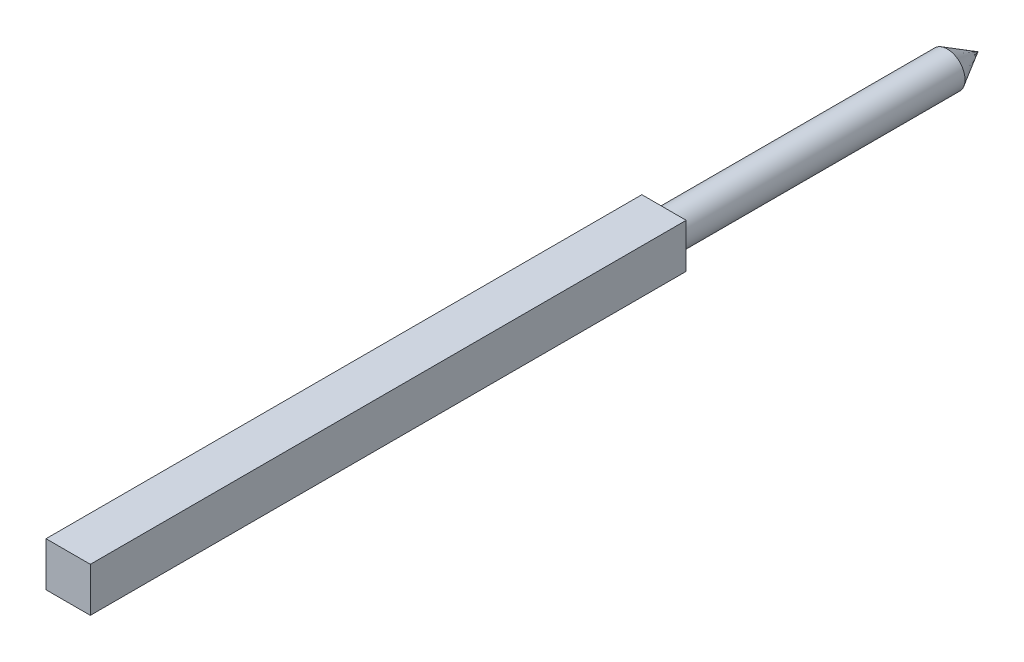
ISO-10303-21;
HEADER;
FILE_DESCRIPTION(('STEP AP214'),'2;1');
FILE_NAME('part.step','',(''),(''),'','','');
FILE_SCHEMA(('AUTOMOTIVE_DESIGN { 1 0 10303 214 1 1 1 1 }'));
ENDSEC;
DATA;
#1=APPLICATION_CONTEXT('core data for automotive mechanical design processes');
#2=APPLICATION_PROTOCOL_DEFINITION('international standard','automotive_design',2000,#1);
#3=PRODUCT_CONTEXT('',#1,'mechanical');
#4=PRODUCT('Part','Part','',(#3));
#5=PRODUCT_RELATED_PRODUCT_CATEGORY('part','',(#4));
#6=PRODUCT_DEFINITION_FORMATION('','',#4);
#7=PRODUCT_DEFINITION_CONTEXT('part definition',#1,'design');
#8=PRODUCT_DEFINITION('design','',#6,#7);
#9=PRODUCT_DEFINITION_SHAPE('','',#8);
#10=(LENGTH_UNIT() NAMED_UNIT(*) SI_UNIT(.MILLI.,.METRE.));
#11=(NAMED_UNIT(*) PLANE_ANGLE_UNIT() SI_UNIT($,.RADIAN.));
#12=(NAMED_UNIT(*) SI_UNIT($,.STERADIAN.) SOLID_ANGLE_UNIT());
#13=UNCERTAINTY_MEASURE_WITH_UNIT(LENGTH_MEASURE(1.E-05),#10,'distance_accuracy_value','');
#14=(GEOMETRIC_REPRESENTATION_CONTEXT(3) GLOBAL_UNCERTAINTY_ASSIGNED_CONTEXT((#13)) GLOBAL_UNIT_ASSIGNED_CONTEXT((#10,
#11,#12)) REPRESENTATION_CONTEXT('',''));
#15=CARTESIAN_POINT('',(0.,0.,0.));
#16=DIRECTION('',(0.,0.,1.));
#17=DIRECTION('',(1.,0.,0.));
#18=AXIS2_PLACEMENT_3D('',#15,#16,#17);
#19=CARTESIAN_POINT('',(-3.13055,-3.1242,84.1375));
#20=DIRECTION('',(0.,1.,0.));
#21=DIRECTION('',(0.,0.,1.));
#22=AXIS2_PLACEMENT_3D('',#19,#20,#21);
#23=PLANE('',#22);
#24=DIRECTION('',(1.,0.,0.));
#25=VECTOR('',#24,1.);
#26=CARTESIAN_POINT('',(-3.13055,-3.1242,0.));
#27=LINE('',#26,#25);
#28=CARTESIAN_POINT('',(-3.13055,-3.1242,0.));
#29=VERTEX_POINT('',#28);
#30=CARTESIAN_POINT('',(3.13055,-3.1242,0.));
#31=VERTEX_POINT('',#30);
#32=EDGE_CURVE('E108',#29,#31,#27,.T.);
#33=ORIENTED_EDGE('',*,*,#32,.T.);
#34=DIRECTION('',(0.,0.,-1.));
#35=VECTOR('',#34,1.);
#36=CARTESIAN_POINT('',(3.13055,-3.1242,84.1375));
#37=LINE('',#36,#35);
#38=CARTESIAN_POINT('',(3.13055,-3.1242,84.1375));
#39=VERTEX_POINT('',#38);
#40=EDGE_CURVE('E13',#39,#31,#37,.T.);
#41=ORIENTED_EDGE('',*,*,#40,.F.);
#42=DIRECTION('',(1.,0.,0.));
#43=VECTOR('',#42,1.);
#44=CARTESIAN_POINT('',(-3.13055,-3.1242,84.1375));
#45=LINE('',#44,#43);
#46=CARTESIAN_POINT('',(-3.13055,-3.1242,84.1375));
#47=VERTEX_POINT('',#46);
#48=EDGE_CURVE('E111',#47,#39,#45,.T.);
#49=ORIENTED_EDGE('',*,*,#48,.F.);
#50=DIRECTION('',(0.,0.,-1.));
#51=VECTOR('',#50,1.);
#52=CARTESIAN_POINT('',(-3.13055,-3.1242,84.1375));
#53=LINE('',#52,#51);
#54=EDGE_CURVE('E65',#47,#29,#53,.T.);
#55=ORIENTED_EDGE('',*,*,#54,.T.);
#56=EDGE_LOOP('',(#33,#41,#49,#55));
#57=FACE_BOUND('',#56,.T.);
#58=ADVANCED_FACE('F49',(#57),#23,.F.);
#59=CARTESIAN_POINT('',(3.13055,-3.1242,84.1375));
#60=DIRECTION('',(-1.,0.,0.));
#61=DIRECTION('',(0.,0.,1.));
#62=AXIS2_PLACEMENT_3D('',#59,#60,#61);
#63=PLANE('',#62);
#64=DIRECTION('',(0.,1.,0.));
#65=VECTOR('',#64,1.);
#66=CARTESIAN_POINT('',(3.13055,-3.1242,0.));
#67=LINE('',#66,#65);
#68=CARTESIAN_POINT('',(3.13055,3.1242,0.));
#69=VERTEX_POINT('',#68);
#70=EDGE_CURVE('E121',#31,#69,#67,.T.);
#71=ORIENTED_EDGE('',*,*,#70,.T.);
#72=DIRECTION('',(0.,0.,-1.));
#73=VECTOR('',#72,1.);
#74=CARTESIAN_POINT('',(3.13055,3.1242,84.1375));
#75=LINE('',#74,#73);
#76=CARTESIAN_POINT('',(3.13055,3.1242,84.1375));
#77=VERTEX_POINT('',#76);
#78=EDGE_CURVE('E57',#77,#69,#75,.T.);
#79=ORIENTED_EDGE('',*,*,#78,.F.);
#80=DIRECTION('',(0.,1.,0.));
#81=VECTOR('',#80,1.);
#82=CARTESIAN_POINT('',(3.13055,-3.1242,84.1375));
#83=LINE('',#82,#81);
#84=EDGE_CURVE('E91',#39,#77,#83,.T.);
#85=ORIENTED_EDGE('',*,*,#84,.F.);
#86=ORIENTED_EDGE('',*,*,#40,.T.);
#87=EDGE_LOOP('',(#71,#79,#85,#86));
#88=FACE_BOUND('',#87,.T.);
#89=ADVANCED_FACE('F133',(#88),#63,.F.);
#90=CARTESIAN_POINT('',(-3.13055,3.1242,84.1375));
#91=DIRECTION('',(0.,1.,0.));
#92=DIRECTION('',(0.,0.,1.));
#93=AXIS2_PLACEMENT_3D('',#90,#91,#92);
#94=PLANE('',#93);
#95=DIRECTION('',(1.,0.,0.));
#96=VECTOR('',#95,1.);
#97=CARTESIAN_POINT('',(-3.13055,3.1242,0.));
#98=LINE('',#97,#96);
#99=CARTESIAN_POINT('',(-3.13055,3.1242,0.));
#100=VERTEX_POINT('',#99);
#101=EDGE_CURVE('E124',#100,#69,#98,.T.);
#102=ORIENTED_EDGE('',*,*,#101,.F.);
#103=DIRECTION('',(0.,0.,-1.));
#104=VECTOR('',#103,1.);
#105=CARTESIAN_POINT('',(-3.13055,3.1242,84.1375));
#106=LINE('',#105,#104);
#107=CARTESIAN_POINT('',(-3.13055,3.1242,84.1375));
#108=VERTEX_POINT('',#107);
#109=EDGE_CURVE('E80',#108,#100,#106,.T.);
#110=ORIENTED_EDGE('',*,*,#109,.F.);
#111=DIRECTION('',(1.,0.,0.));
#112=VECTOR('',#111,1.);
#113=CARTESIAN_POINT('',(-3.13055,3.1242,84.1375));
#114=LINE('',#113,#112);
#115=EDGE_CURVE('E115',#108,#77,#114,.T.);
#116=ORIENTED_EDGE('',*,*,#115,.T.);
#117=ORIENTED_EDGE('',*,*,#78,.T.);
#118=EDGE_LOOP('',(#102,#110,#116,#117));
#119=FACE_BOUND('',#118,.T.);
#120=ADVANCED_FACE('F131',(#119),#94,.T.);
#121=CARTESIAN_POINT('',(-3.13055,-3.1242,84.1375));
#122=DIRECTION('',(-1.,0.,0.));
#123=DIRECTION('',(0.,0.,1.));
#124=AXIS2_PLACEMENT_3D('',#121,#122,#123);
#125=PLANE('',#124);
#126=DIRECTION('',(0.,1.,0.));
#127=VECTOR('',#126,1.);
#128=CARTESIAN_POINT('',(-3.13055,-3.1242,0.));
#129=LINE('',#128,#127);
#130=EDGE_CURVE('E113',#29,#100,#129,.T.);
#131=ORIENTED_EDGE('',*,*,#130,.F.);
#132=ORIENTED_EDGE('',*,*,#54,.F.);
#133=DIRECTION('',(0.,1.,0.));
#134=VECTOR('',#133,1.);
#135=CARTESIAN_POINT('',(-3.13055,-3.1242,84.1375));
#136=LINE('',#135,#134);
#137=EDGE_CURVE('E118',#47,#108,#136,.T.);
#138=ORIENTED_EDGE('',*,*,#137,.T.);
#139=ORIENTED_EDGE('',*,*,#109,.T.);
#140=EDGE_LOOP('',(#131,#132,#138,#139));
#141=FACE_BOUND('',#140,.T.);
#142=ADVANCED_FACE('F137',(#141),#125,.T.);
#143=CARTESIAN_POINT('',(0.,0.,84.1375));
#144=DIRECTION('',(0.,0.,1.));
#145=DIRECTION('',(1.,0.,0.));
#146=AXIS2_PLACEMENT_3D('',#143,#144,#145);
#147=PLANE('',#146);
#148=ORIENTED_EDGE('',*,*,#48,.T.);
#149=ORIENTED_EDGE('',*,*,#84,.T.);
#150=ORIENTED_EDGE('',*,*,#115,.F.);
#151=ORIENTED_EDGE('',*,*,#137,.F.);
#152=EDGE_LOOP('',(#148,#149,#150,#151));
#153=FACE_BOUND('',#152,.T.);
#154=ADVANCED_FACE('F139',(#153),#147,.T.);
#155=CARTESIAN_POINT('',(0.,0.,0.));
#156=DIRECTION('',(0.,0.,1.));
#157=DIRECTION('',(1.,0.,0.));
#158=AXIS2_PLACEMENT_3D('',#155,#156,#157);
#159=PLANE('',#158);
#160=CARTESIAN_POINT('',(0.,0.,0.));
#161=DIRECTION('',(0.,0.,1.));
#162=DIRECTION('',(1.,0.,0.));
#163=AXIS2_PLACEMENT_3D('',#160,#161,#162);
#164=CIRCLE('',#163,2.499995);
#165=CARTESIAN_POINT('',(2.499995,0.,0.));
#166=VERTEX_POINT('',#165);
#167=EDGE_CURVE('E105',#166,#166,#164,.T.);
#168=ORIENTED_EDGE('',*,*,#167,.T.);
#169=EDGE_LOOP('',(#168));
#170=FACE_BOUND('',#169,.T.);
#171=ORIENTED_EDGE('',*,*,#32,.F.);
#172=ORIENTED_EDGE('',*,*,#130,.T.);
#173=ORIENTED_EDGE('',*,*,#101,.T.);
#174=ORIENTED_EDGE('',*,*,#70,.F.);
#175=EDGE_LOOP('',(#171,#172,#173,#174));
#176=FACE_BOUND('',#175,.T.);
#177=ADVANCED_FACE('F136',(#170,#176),#159,.F.);
#178=CARTESIAN_POINT('',(0.,0.,-40.005));
#179=DIRECTION('',(0.,0.,1.));
#180=DIRECTION('',(1.,0.,0.));
#181=AXIS2_PLACEMENT_3D('',#178,#179,#180);
#182=CYLINDRICAL_SURFACE('',#181,2.499995);
#183=CARTESIAN_POINT('',(0.,0.,-40.005));
#184=DIRECTION('',(0.,0.,-1.));
#185=DIRECTION('',(-1.,0.,0.));
#186=AXIS2_PLACEMENT_3D('',#183,#184,#185);
#187=CIRCLE('',#186,2.499995);
#188=CARTESIAN_POINT('',(-2.499995,0.,-40.005));
#189=VERTEX_POINT('',#188);
#190=EDGE_CURVE('E103',#189,#189,#187,.T.);
#191=ORIENTED_EDGE('',*,*,#190,.F.);
#192=EDGE_LOOP('',(#191));
#193=FACE_BOUND('',#192,.T.);
#194=ORIENTED_EDGE('',*,*,#167,.F.);
#195=EDGE_LOOP('',(#194));
#196=FACE_BOUND('',#195,.T.);
#197=ADVANCED_FACE('F99',(#193,#196),#182,.T.);
#198=CARTESIAN_POINT('',(0.,0.,-40.005));
#199=DIRECTION('',(0.,0.,1.));
#200=DIRECTION('',(-1.,0.,0.));
#201=AXIS2_PLACEMENT_3D('',#198,#199,#200);
#202=CONICAL_SURFACE('',#201,2.499995,0.5235987755983);
#203=CARTESIAN_POINT('',(0.,0.,-44.3351183586681));
#204=VERTEX_POINT('',#203);
#205=VERTEX_LOOP('',#204);
#206=FACE_BOUND('',#205,.T.);
#207=ORIENTED_EDGE('',*,*,#190,.T.);
#208=EDGE_LOOP('',(#207));
#209=FACE_BOUND('',#208,.T.);
#210=ADVANCED_FACE('F96',(#206,#209),#202,.T.);
#211=CLOSED_SHELL('',(#58,#89,#120,#142,#154,#177,#197,#210));
#212=MANIFOLD_SOLID_BREP('B2',#211);
#213=ADVANCED_BREP_SHAPE_REPRESENTATION('',(#18,#212),#14);
#214=SHAPE_DEFINITION_REPRESENTATION(#9,#213);
ENDSEC;
END-ISO-10303-21;
